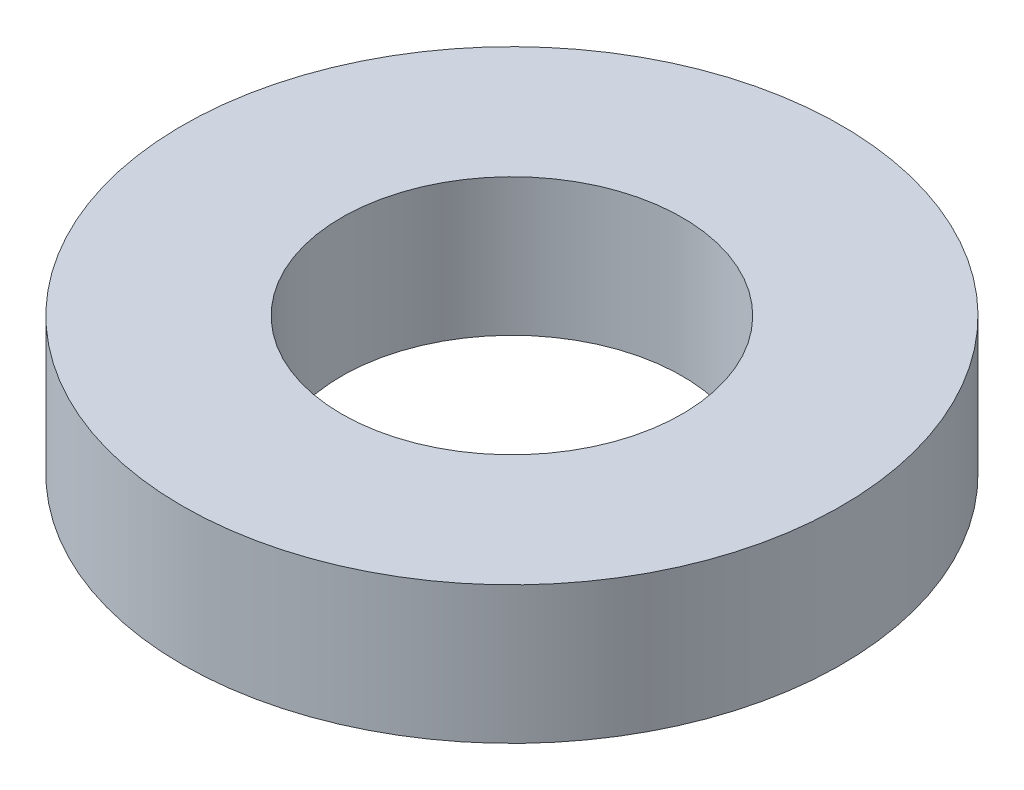
ISO-10303-21;
HEADER;
FILE_DESCRIPTION(('STEP AP214'),'2;1');
FILE_NAME('part.step','',(''),(''),'','','');
FILE_SCHEMA(('AUTOMOTIVE_DESIGN { 1 0 10303 214 1 1 1 1 }'));
ENDSEC;
DATA;
#1=APPLICATION_CONTEXT('core data for automotive mechanical design processes');
#2=APPLICATION_PROTOCOL_DEFINITION('international standard','automotive_design',2000,#1);
#3=PRODUCT_CONTEXT('',#1,'mechanical');
#4=PRODUCT('Part','Part','',(#3));
#5=PRODUCT_RELATED_PRODUCT_CATEGORY('part','',(#4));
#6=PRODUCT_DEFINITION_FORMATION('','',#4);
#7=PRODUCT_DEFINITION_CONTEXT('part definition',#1,'design');
#8=PRODUCT_DEFINITION('design','',#6,#7);
#9=PRODUCT_DEFINITION_SHAPE('','',#8);
#10=(LENGTH_UNIT() NAMED_UNIT(*) SI_UNIT(.MILLI.,.METRE.));
#11=(NAMED_UNIT(*) PLANE_ANGLE_UNIT() SI_UNIT($,.RADIAN.));
#12=(NAMED_UNIT(*) SI_UNIT($,.STERADIAN.) SOLID_ANGLE_UNIT());
#13=UNCERTAINTY_MEASURE_WITH_UNIT(LENGTH_MEASURE(1.E-05),#10,'distance_accuracy_value','');
#14=(GEOMETRIC_REPRESENTATION_CONTEXT(3) GLOBAL_UNCERTAINTY_ASSIGNED_CONTEXT((#13)) GLOBAL_UNIT_ASSIGNED_CONTEXT((#10,
#11,#12)) REPRESENTATION_CONTEXT('',''));
#15=CARTESIAN_POINT('',(0.,0.,0.));
#16=DIRECTION('',(0.,0.,1.));
#17=DIRECTION('',(1.,0.,0.));
#18=AXIS2_PLACEMENT_3D('',#15,#16,#17);
#19=CARTESIAN_POINT('',(0.,1.25,0.));
#20=DIRECTION('',(0.,1.,0.));
#21=DIRECTION('',(0.,0.,1.));
#22=AXIS2_PLACEMENT_3D('',#19,#20,#21);
#23=PLANE('',#22);
#24=CARTESIAN_POINT('',(0.,1.25,0.));
#25=DIRECTION('',(0.,1.,0.));
#26=DIRECTION('',(0.,0.,1.));
#27=AXIS2_PLACEMENT_3D('',#24,#25,#26);
#28=CIRCLE('',#27,3.);
#29=CARTESIAN_POINT('',(0.,1.25,3.));
#30=VERTEX_POINT('',#29);
#31=EDGE_CURVE('E10',#30,#30,#28,.T.);
#32=ORIENTED_EDGE('',*,*,#31,.T.);
#33=EDGE_LOOP('',(#32));
#34=FACE_BOUND('',#33,.T.);
#35=CARTESIAN_POINT('',(0.,1.25,0.));
#36=DIRECTION('',(0.,1.,0.));
#37=DIRECTION('',(0.,0.,1.));
#38=AXIS2_PLACEMENT_3D('',#35,#36,#37);
#39=CIRCLE('',#38,1.55);
#40=CARTESIAN_POINT('',(0.,1.25,1.55));
#41=VERTEX_POINT('',#40);
#42=EDGE_CURVE('E43',#41,#41,#39,.T.);
#43=ORIENTED_EDGE('',*,*,#42,.F.);
#44=EDGE_LOOP('',(#43));
#45=FACE_BOUND('',#44,.T.);
#46=ADVANCED_FACE('F32',(#34,#45),#23,.T.);
#47=CARTESIAN_POINT('',(0.,0.,0.));
#48=DIRECTION('',(0.,1.,0.));
#49=DIRECTION('',(0.,0.,1.));
#50=AXIS2_PLACEMENT_3D('',#47,#48,#49);
#51=PLANE('',#50);
#52=CARTESIAN_POINT('',(0.,0.,0.));
#53=DIRECTION('',(0.,1.,0.));
#54=DIRECTION('',(0.,0.,1.));
#55=AXIS2_PLACEMENT_3D('',#52,#53,#54);
#56=CIRCLE('',#55,3.);
#57=CARTESIAN_POINT('',(0.,0.,3.));
#58=VERTEX_POINT('',#57);
#59=EDGE_CURVE('E36',#58,#58,#56,.T.);
#60=ORIENTED_EDGE('',*,*,#59,.F.);
#61=EDGE_LOOP('',(#60));
#62=FACE_BOUND('',#61,.T.);
#63=CARTESIAN_POINT('',(0.,0.,0.));
#64=DIRECTION('',(0.,1.,0.));
#65=DIRECTION('',(0.,0.,1.));
#66=AXIS2_PLACEMENT_3D('',#63,#64,#65);
#67=CIRCLE('',#66,1.55);
#68=CARTESIAN_POINT('',(0.,0.,1.55));
#69=VERTEX_POINT('',#68);
#70=EDGE_CURVE('E45',#69,#69,#67,.T.);
#71=ORIENTED_EDGE('',*,*,#70,.T.);
#72=EDGE_LOOP('',(#71));
#73=FACE_BOUND('',#72,.T.);
#74=ADVANCED_FACE('F55',(#62,#73),#51,.F.);
#75=CARTESIAN_POINT('',(0.,1.25,0.));
#76=DIRECTION('',(0.,-1.,0.));
#77=DIRECTION('',(0.,0.,-1.));
#78=AXIS2_PLACEMENT_3D('',#75,#76,#77);
#79=CYLINDRICAL_SURFACE('',#78,3.);
#80=ORIENTED_EDGE('',*,*,#31,.F.);
#81=EDGE_LOOP('',(#80));
#82=FACE_BOUND('',#81,.T.);
#83=ORIENTED_EDGE('',*,*,#59,.T.);
#84=EDGE_LOOP('',(#83));
#85=FACE_BOUND('',#84,.T.);
#86=ADVANCED_FACE('F34',(#82,#85),#79,.T.);
#87=CARTESIAN_POINT('',(0.,1.25,0.));
#88=DIRECTION('',(0.,-1.,0.));
#89=DIRECTION('',(0.,0.,-1.));
#90=AXIS2_PLACEMENT_3D('',#87,#88,#89);
#91=CYLINDRICAL_SURFACE('',#90,1.55);
#92=ORIENTED_EDGE('',*,*,#42,.T.);
#93=EDGE_LOOP('',(#92));
#94=FACE_BOUND('',#93,.T.);
#95=ORIENTED_EDGE('',*,*,#70,.F.);
#96=EDGE_LOOP('',(#95));
#97=FACE_BOUND('',#96,.T.);
#98=ADVANCED_FACE('F51',(#94,#97),#91,.F.);
#99=CLOSED_SHELL('',(#46,#74,#86,#98));
#100=MANIFOLD_SOLID_BREP('B2',#99);
#101=ADVANCED_BREP_SHAPE_REPRESENTATION('',(#18,#100),#14);
#102=SHAPE_DEFINITION_REPRESENTATION(#9,#101);
ENDSEC;
END-ISO-10303-21;
